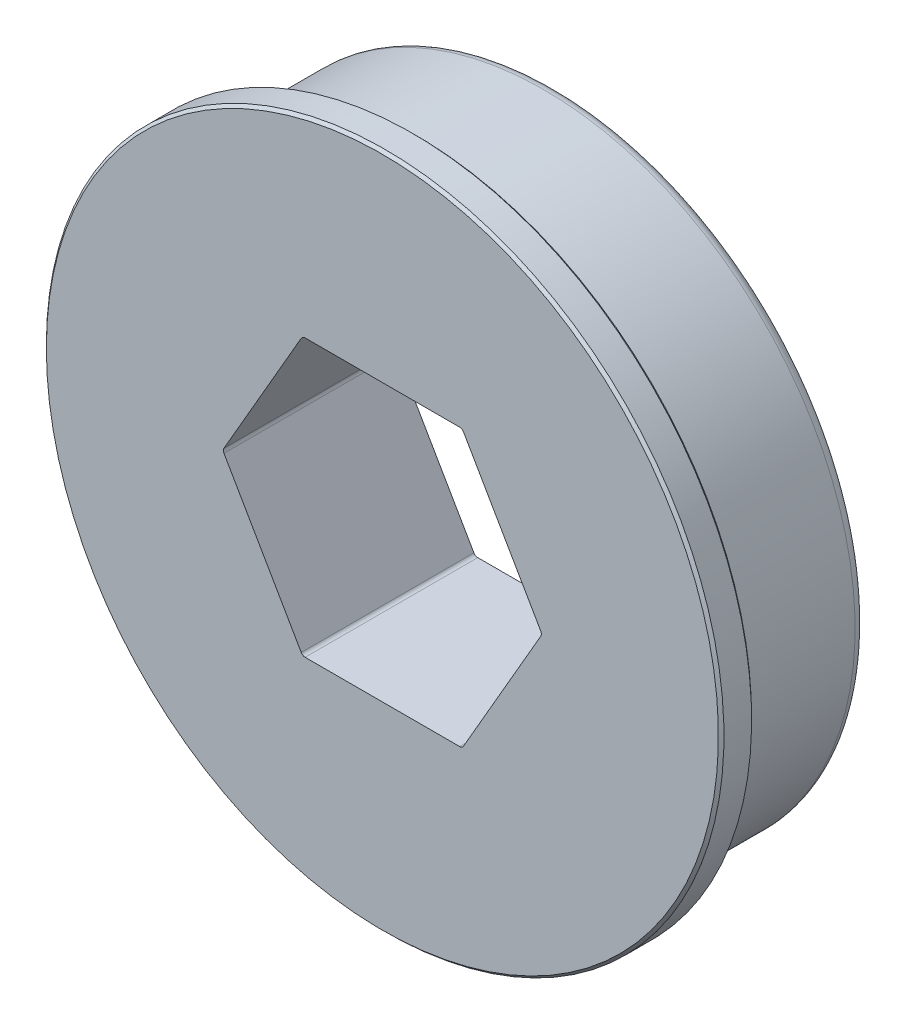
ISO-10303-21;
HEADER;
FILE_DESCRIPTION(('STEP AP214'),'2;1');
FILE_NAME('part.step','',(''),(''),'','','');
FILE_SCHEMA(('AUTOMOTIVE_DESIGN { 1 0 10303 214 1 1 1 1 }'));
ENDSEC;
DATA;
#1=APPLICATION_CONTEXT('core data for automotive mechanical design processes');
#2=APPLICATION_PROTOCOL_DEFINITION('international standard','automotive_design',2000,#1);
#3=PRODUCT_CONTEXT('',#1,'mechanical');
#4=PRODUCT('Part','Part','',(#3));
#5=PRODUCT_RELATED_PRODUCT_CATEGORY('part','',(#4));
#6=PRODUCT_DEFINITION_FORMATION('','',#4);
#7=PRODUCT_DEFINITION_CONTEXT('part definition',#1,'design');
#8=PRODUCT_DEFINITION('design','',#6,#7);
#9=PRODUCT_DEFINITION_SHAPE('','',#8);
#10=(LENGTH_UNIT() NAMED_UNIT(*) SI_UNIT(.MILLI.,.METRE.));
#11=(NAMED_UNIT(*) PLANE_ANGLE_UNIT() SI_UNIT($,.RADIAN.));
#12=(NAMED_UNIT(*) SI_UNIT($,.STERADIAN.) SOLID_ANGLE_UNIT());
#13=UNCERTAINTY_MEASURE_WITH_UNIT(LENGTH_MEASURE(1.E-05),#10,'distance_accuracy_value','');
#14=(GEOMETRIC_REPRESENTATION_CONTEXT(3) GLOBAL_UNCERTAINTY_ASSIGNED_CONTEXT((#13)) GLOBAL_UNIT_ASSIGNED_CONTEXT((#10,
#11,#12)) REPRESENTATION_CONTEXT('',''));
#15=CARTESIAN_POINT('',(0.,0.,0.));
#16=DIRECTION('',(0.,0.,1.));
#17=DIRECTION('',(1.,0.,0.));
#18=AXIS2_PLACEMENT_3D('',#15,#16,#17);
#19=CARTESIAN_POINT('',(0.,0.,7.92734));
#20=DIRECTION('',(0.,0.,-1.));
#21=DIRECTION('',(-1.,0.,0.));
#22=AXIS2_PLACEMENT_3D('',#19,#20,#21);
#23=CYLINDRICAL_SURFACE('',#22,13.97);
#24=CARTESIAN_POINT('',(0.,0.,6.40333999999999));
#25=DIRECTION('',(0.,0.,-1.));
#26=DIRECTION('',(-1.,0.,0.));
#27=AXIS2_PLACEMENT_3D('',#24,#25,#26);
#28=CIRCLE('',#27,13.97);
#29=CARTESIAN_POINT('',(-13.97,0.,6.40333999999999));
#30=VERTEX_POINT('',#29);
#31=EDGE_CURVE('E254',#30,#30,#28,.F.);
#32=ORIENTED_EDGE('',*,*,#31,.F.);
#33=EDGE_LOOP('',(#32));
#34=FACE_BOUND('',#33,.T.);
#35=CARTESIAN_POINT('',(0.,0.,5.89534));
#36=DIRECTION('',(0.,0.,-1.));
#37=DIRECTION('',(-1.,0.,0.));
#38=AXIS2_PLACEMENT_3D('',#35,#36,#37);
#39=CIRCLE('',#38,13.97);
#40=CARTESIAN_POINT('',(-13.97,0.,5.89534));
#41=VERTEX_POINT('',#40);
#42=EDGE_CURVE('E257',#41,#41,#39,.T.);
#43=ORIENTED_EDGE('',*,*,#42,.F.);
#44=EDGE_LOOP('',(#43));
#45=FACE_BOUND('',#44,.T.);
#46=ADVANCED_FACE('F16',(#34,#45),#23,.T.);
#47=CARTESIAN_POINT('',(14.2875,0.,5.89534));
#48=DIRECTION('',(0.,0.,1.));
#49=DIRECTION('',(1.,0.,0.));
#50=AXIS2_PLACEMENT_3D('',#47,#48,#49);
#51=PLANE('',#50);
#52=CARTESIAN_POINT('',(0.,0.,5.89534));
#53=DIRECTION('',(0.,0.,-1.));
#54=DIRECTION('',(-1.,0.,0.));
#55=AXIS2_PLACEMENT_3D('',#52,#53,#54);
#56=CIRCLE('',#55,14.2875);
#57=CARTESIAN_POINT('',(-14.2875,0.,5.89534));
#58=VERTEX_POINT('',#57);
#59=EDGE_CURVE('E251',#58,#58,#56,.T.);
#60=ORIENTED_EDGE('',*,*,#59,.F.);
#61=EDGE_LOOP('',(#60));
#62=FACE_BOUND('',#61,.T.);
#63=ORIENTED_EDGE('',*,*,#42,.T.);
#64=EDGE_LOOP('',(#63));
#65=FACE_BOUND('',#64,.T.);
#66=ADVANCED_FACE('F374',(#62,#65),#51,.T.);
#67=CARTESIAN_POINT('',(13.97,0.,6.40334));
#68=DIRECTION('',(0.,0.,-1.));
#69=DIRECTION('',(-1.,0.,0.));
#70=AXIS2_PLACEMENT_3D('',#67,#68,#69);
#71=PLANE('',#70);
#72=ORIENTED_EDGE('',*,*,#31,.T.);
#73=EDGE_LOOP('',(#72));
#74=FACE_BOUND('',#73,.T.);
#75=CARTESIAN_POINT('',(0.,0.,6.40334));
#76=DIRECTION('',(0.,0.,1.));
#77=DIRECTION('',(0.,-1.,0.));
#78=AXIS2_PLACEMENT_3D('',#75,#76,#77);
#79=CIRCLE('',#78,15.4305);
#80=CARTESIAN_POINT('',(0.,-15.4305,6.40334));
#81=VERTEX_POINT('',#80);
#82=EDGE_CURVE('E222',#81,#81,#79,.T.);
#83=ORIENTED_EDGE('',*,*,#82,.F.);
#84=EDGE_LOOP('',(#83));
#85=FACE_BOUND('',#84,.T.);
#86=ADVANCED_FACE('F372',(#74,#85),#71,.T.);
#87=CARTESIAN_POINT('',(0.,0.,7.92734));
#88=DIRECTION('',(0.,0.,-1.));
#89=DIRECTION('',(-1.,0.,0.));
#90=AXIS2_PLACEMENT_3D('',#87,#88,#89);
#91=CYLINDRICAL_SURFACE('',#90,14.2875);
#92=ORIENTED_EDGE('',*,*,#59,.T.);
#93=EDGE_LOOP('',(#92));
#94=FACE_BOUND('',#93,.T.);
#95=CARTESIAN_POINT('',(0.,0.,0.508));
#96=DIRECTION('',(0.,0.,-1.));
#97=DIRECTION('',(-1.,0.,0.));
#98=AXIS2_PLACEMENT_3D('',#95,#96,#97);
#99=CIRCLE('',#98,14.2875);
#100=CARTESIAN_POINT('',(-14.2875,0.,0.508));
#101=VERTEX_POINT('',#100);
#102=EDGE_CURVE('E219',#101,#101,#99,.T.);
#103=ORIENTED_EDGE('',*,*,#102,.F.);
#104=EDGE_LOOP('',(#103));
#105=FACE_BOUND('',#104,.T.);
#106=ADVANCED_FACE('F369',(#94,#105),#91,.T.);
#107=CARTESIAN_POINT('',(0.,0.,6.53034000000001));
#108=DIRECTION('',(0.,0.,1.));
#109=DIRECTION('',(0.,-1.,0.));
#110=AXIS2_PLACEMENT_3D('',#107,#108,#109);
#111=CONICAL_SURFACE('',#110,15.5575,0.785398163397469);
#112=CARTESIAN_POINT('',(0.,0.,6.53034000000001));
#113=DIRECTION('',(0.,0.,-1.));
#114=DIRECTION('',(-1.,0.,0.));
#115=AXIS2_PLACEMENT_3D('',#112,#113,#114);
#116=CIRCLE('',#115,15.5575);
#117=CARTESIAN_POINT('',(-15.5575,0.,6.53034000000001));
#118=VERTEX_POINT('',#117);
#119=EDGE_CURVE('E83',#118,#118,#116,.F.);
#120=ORIENTED_EDGE('',*,*,#119,.F.);
#121=EDGE_LOOP('',(#120));
#122=FACE_BOUND('',#121,.T.);
#123=ORIENTED_EDGE('',*,*,#82,.T.);
#124=EDGE_LOOP('',(#123));
#125=FACE_BOUND('',#124,.T.);
#126=ADVANCED_FACE('F204',(#122,#125),#111,.T.);
#127=CARTESIAN_POINT('',(0.,0.,0.508));
#128=DIRECTION('',(0.,0.,-1.));
#129=DIRECTION('',(-1.,0.,0.));
#130=AXIS2_PLACEMENT_3D('',#127,#128,#129);
#131=TOROIDAL_SURFACE('',#130,13.7795,0.508);
#132=ORIENTED_EDGE('',*,*,#102,.T.);
#133=EDGE_LOOP('',(#132));
#134=FACE_BOUND('',#133,.T.);
#135=CARTESIAN_POINT('',(0.,0.,0.));
#136=DIRECTION('',(0.,0.,1.));
#137=DIRECTION('',(-1.,0.,0.));
#138=AXIS2_PLACEMENT_3D('',#135,#136,#137);
#139=CIRCLE('',#138,13.7795);
#140=CARTESIAN_POINT('',(13.7795,0.,0.));
#141=VERTEX_POINT('',#140);
#142=CARTESIAN_POINT('',(-13.7795,0.,0.));
#143=VERTEX_POINT('',#142);
#144=EDGE_CURVE('E242',#141,#143,#139,.F.);
#145=ORIENTED_EDGE('',*,*,#144,.F.);
#146=CARTESIAN_POINT('',(0.,0.,0.));
#147=DIRECTION('',(0.,0.,1.));
#148=DIRECTION('',(1.,0.,0.));
#149=AXIS2_PLACEMENT_3D('',#146,#147,#148);
#150=CIRCLE('',#149,13.7795);
#151=EDGE_CURVE('E152',#143,#141,#150,.F.);
#152=ORIENTED_EDGE('',*,*,#151,.F.);
#153=EDGE_LOOP('',(#145,#152));
#154=FACE_BOUND('',#153,.T.);
#155=ADVANCED_FACE('F198',(#134,#154),#131,.T.);
#156=CARTESIAN_POINT('',(0.,0.,7.92734));
#157=DIRECTION('',(0.,0.,-1.));
#158=DIRECTION('',(-1.,0.,0.));
#159=AXIS2_PLACEMENT_3D('',#156,#157,#158);
#160=CYLINDRICAL_SURFACE('',#159,15.5575);
#161=ORIENTED_EDGE('',*,*,#119,.T.);
#162=EDGE_LOOP('',(#161));
#163=FACE_BOUND('',#162,.T.);
#164=CARTESIAN_POINT('',(0.,0.,7.80034));
#165=DIRECTION('',(0.,0.,-1.));
#166=DIRECTION('',(-1.,0.,0.));
#167=AXIS2_PLACEMENT_3D('',#164,#165,#166);
#168=CIRCLE('',#167,15.5575);
#169=CARTESIAN_POINT('',(-15.5575,0.,7.80034));
#170=VERTEX_POINT('',#169);
#171=EDGE_CURVE('E143',#170,#170,#168,.F.);
#172=ORIENTED_EDGE('',*,*,#171,.F.);
#173=EDGE_LOOP('',(#172));
#174=FACE_BOUND('',#173,.T.);
#175=ADVANCED_FACE('F203',(#163,#174),#160,.T.);
#176=CARTESIAN_POINT('',(-7.09771326930958,0.,7.92734));
#177=DIRECTION('',(0.,0.,1.));
#178=DIRECTION('',(1.,0.,0.));
#179=AXIS2_PLACEMENT_3D('',#176,#177,#178);
#180=CYLINDRICAL_SURFACE('',#179,0.2032);
#181=DIRECTION('',(0.,0.,1.));
#182=VECTOR('',#181,1.);
#183=CARTESIAN_POINT('',(-7.27368963135858,-0.101600000000005,7.92734));
#184=LINE('',#183,#182);
#185=CARTESIAN_POINT('',(-7.27368963135857,-0.101600000000005,7.92734));
#186=VERTEX_POINT('',#185);
#187=CARTESIAN_POINT('',(-7.27368963135858,-0.101600000000005,0.));
#188=VERTEX_POINT('',#187);
#189=EDGE_CURVE('E141',#186,#188,#184,.F.);
#190=ORIENTED_EDGE('',*,*,#189,.T.);
#191=CARTESIAN_POINT('',(-7.09771326930958,0.,0.));
#192=DIRECTION('',(0.,0.,1.));
#193=DIRECTION('',(1.,0.,0.));
#194=AXIS2_PLACEMENT_3D('',#191,#192,#193);
#195=CIRCLE('',#194,0.2032);
#196=CARTESIAN_POINT('',(-7.27368963135857,0.101599999999994,0.));
#197=VERTEX_POINT('',#196);
#198=EDGE_CURVE('E91',#197,#188,#195,.T.);
#199=ORIENTED_EDGE('',*,*,#198,.F.);
#200=DIRECTION('',(0.,0.,1.));
#201=VECTOR('',#200,1.);
#202=CARTESIAN_POINT('',(-7.27368963135857,0.101599999999994,7.92734));
#203=LINE('',#202,#201);
#204=CARTESIAN_POINT('',(-7.27368963135857,0.101599999999993,7.92734));
#205=VERTEX_POINT('',#204);
#206=EDGE_CURVE('E87',#197,#205,#203,.T.);
#207=ORIENTED_EDGE('',*,*,#206,.T.);
#208=CARTESIAN_POINT('',(-7.09771326930958,0.,7.92734));
#209=DIRECTION('',(0.,0.,1.));
#210=DIRECTION('',(1.,0.,0.));
#211=AXIS2_PLACEMENT_3D('',#208,#209,#210);
#212=CIRCLE('',#211,0.2032);
#213=EDGE_CURVE('E71',#186,#205,#212,.F.);
#214=ORIENTED_EDGE('',*,*,#213,.F.);
#215=EDGE_LOOP('',(#190,#199,#207,#214));
#216=FACE_BOUND('',#215,.T.);
#217=ADVANCED_FACE('F88',(#216),#180,.F.);
#218=CARTESIAN_POINT('',(-3.54885663465479,6.14679999999999,7.92734));
#219=DIRECTION('',(0.,0.,1.));
#220=DIRECTION('',(1.,0.,0.));
#221=AXIS2_PLACEMENT_3D('',#218,#219,#220);
#222=CYLINDRICAL_SURFACE('',#221,0.2032);
#223=DIRECTION('',(0.,0.,1.));
#224=VECTOR('',#223,1.);
#225=CARTESIAN_POINT('',(-3.72483299670379,6.24839999999999,7.92734));
#226=LINE('',#225,#224);
#227=CARTESIAN_POINT('',(-3.72483299670379,6.24839999999999,7.92734));
#228=VERTEX_POINT('',#227);
#229=CARTESIAN_POINT('',(-3.72483299670379,6.24839999999999,0.));
#230=VERTEX_POINT('',#229);
#231=EDGE_CURVE('E101',#228,#230,#226,.F.);
#232=ORIENTED_EDGE('',*,*,#231,.T.);
#233=CARTESIAN_POINT('',(-3.54885663465479,6.14679999999999,0.));
#234=DIRECTION('',(0.,0.,1.));
#235=DIRECTION('',(1.,0.,0.));
#236=AXIS2_PLACEMENT_3D('',#233,#234,#235);
#237=CIRCLE('',#236,0.2032);
#238=CARTESIAN_POINT('',(-3.54885663465479,6.34999999999999,0.));
#239=VERTEX_POINT('',#238);
#240=EDGE_CURVE('E229',#239,#230,#237,.T.);
#241=ORIENTED_EDGE('',*,*,#240,.F.);
#242=DIRECTION('',(0.,0.,1.));
#243=VECTOR('',#242,1.);
#244=CARTESIAN_POINT('',(-3.54885663465479,6.34999999999999,7.92734));
#245=LINE('',#244,#243);
#246=CARTESIAN_POINT('',(-3.54885663465479,6.34999999999999,7.92734));
#247=VERTEX_POINT('',#246);
#248=EDGE_CURVE('E95',#239,#247,#245,.T.);
#249=ORIENTED_EDGE('',*,*,#248,.T.);
#250=CARTESIAN_POINT('',(-3.54885663465479,6.14679999999999,7.92734));
#251=DIRECTION('',(0.,0.,1.));
#252=DIRECTION('',(1.,0.,0.));
#253=AXIS2_PLACEMENT_3D('',#250,#251,#252);
#254=CIRCLE('',#253,0.2032);
#255=EDGE_CURVE('E82',#228,#247,#254,.F.);
#256=ORIENTED_EDGE('',*,*,#255,.F.);
#257=EDGE_LOOP('',(#232,#241,#249,#256));
#258=FACE_BOUND('',#257,.T.);
#259=ADVANCED_FACE('F319',(#258),#222,.F.);
#260=CARTESIAN_POINT('',(3.5488566346548,6.1468,7.92734));
#261=DIRECTION('',(0.,0.,1.));
#262=DIRECTION('',(1.,0.,0.));
#263=AXIS2_PLACEMENT_3D('',#260,#261,#262);
#264=CYLINDRICAL_SURFACE('',#263,0.2032);
#265=DIRECTION('',(0.,0.,1.));
#266=VECTOR('',#265,1.);
#267=CARTESIAN_POINT('',(3.5488566346548,6.35,7.92734));
#268=LINE('',#267,#266);
#269=CARTESIAN_POINT('',(3.5488566346548,6.34999999999999,7.92734));
#270=VERTEX_POINT('',#269);
#271=CARTESIAN_POINT('',(3.5488566346548,6.35,0.));
#272=VERTEX_POINT('',#271);
#273=EDGE_CURVE('E134',#270,#272,#268,.F.);
#274=ORIENTED_EDGE('',*,*,#273,.T.);
#275=CARTESIAN_POINT('',(3.5488566346548,6.1468,0.));
#276=DIRECTION('',(0.,0.,1.));
#277=DIRECTION('',(1.,0.,0.));
#278=AXIS2_PLACEMENT_3D('',#275,#276,#277);
#279=CIRCLE('',#278,0.2032);
#280=CARTESIAN_POINT('',(3.7248329967038,6.2484,0.));
#281=VERTEX_POINT('',#280);
#282=EDGE_CURVE('E232',#281,#272,#279,.T.);
#283=ORIENTED_EDGE('',*,*,#282,.F.);
#284=DIRECTION('',(0.,0.,1.));
#285=VECTOR('',#284,1.);
#286=CARTESIAN_POINT('',(3.72483299670379,6.2484,7.92734));
#287=LINE('',#286,#285);
#288=CARTESIAN_POINT('',(3.7248329967038,6.2484,7.92734));
#289=VERTEX_POINT('',#288);
#290=EDGE_CURVE('E124',#281,#289,#287,.T.);
#291=ORIENTED_EDGE('',*,*,#290,.T.);
#292=CARTESIAN_POINT('',(3.5488566346548,6.1468,7.92734));
#293=DIRECTION('',(0.,0.,1.));
#294=DIRECTION('',(1.,0.,0.));
#295=AXIS2_PLACEMENT_3D('',#292,#293,#294);
#296=CIRCLE('',#295,0.2032);
#297=EDGE_CURVE('E246',#270,#289,#296,.F.);
#298=ORIENTED_EDGE('',*,*,#297,.F.);
#299=EDGE_LOOP('',(#274,#283,#291,#298));
#300=FACE_BOUND('',#299,.T.);
#301=ADVANCED_FACE('F325',(#300),#264,.F.);
#302=CARTESIAN_POINT('',(7.09771326930959,0.,7.92734));
#303=DIRECTION('',(0.,0.,1.));
#304=DIRECTION('',(1.,0.,0.));
#305=AXIS2_PLACEMENT_3D('',#302,#303,#304);
#306=CYLINDRICAL_SURFACE('',#305,0.2032);
#307=CARTESIAN_POINT('',(7.09771326930959,0.,0.));
#308=DIRECTION('',(0.,0.,1.));
#309=DIRECTION('',(1.,0.,0.));
#310=AXIS2_PLACEMENT_3D('',#307,#308,#309);
#311=CIRCLE('',#310,0.2032);
#312=CARTESIAN_POINT('',(7.27368963135859,-0.101600000000005,0.));
#313=VERTEX_POINT('',#312);
#314=CARTESIAN_POINT('',(7.27368963135859,0.101599999999995,0.));
#315=VERTEX_POINT('',#314);
#316=EDGE_CURVE('E235',#313,#315,#311,.T.);
#317=ORIENTED_EDGE('',*,*,#316,.F.);
#318=DIRECTION('',(0.,0.,1.));
#319=VECTOR('',#318,1.);
#320=CARTESIAN_POINT('',(7.27368963135859,-0.101600000000005,7.92734));
#321=LINE('',#320,#319);
#322=CARTESIAN_POINT('',(7.27368963135859,-0.101600000000005,7.92734));
#323=VERTEX_POINT('',#322);
#324=EDGE_CURVE('E117',#313,#323,#321,.T.);
#325=ORIENTED_EDGE('',*,*,#324,.T.);
#326=CARTESIAN_POINT('',(7.09771326930959,0.,7.92734));
#327=DIRECTION('',(0.,0.,1.));
#328=DIRECTION('',(1.,0.,0.));
#329=AXIS2_PLACEMENT_3D('',#326,#327,#328);
#330=CIRCLE('',#329,0.2032);
#331=CARTESIAN_POINT('',(7.27368963135859,0.101599999999995,7.92734));
#332=VERTEX_POINT('',#331);
#333=EDGE_CURVE('E244',#332,#323,#330,.F.);
#334=ORIENTED_EDGE('',*,*,#333,.F.);
#335=DIRECTION('',(0.,0.,1.));
#336=VECTOR('',#335,1.);
#337=CARTESIAN_POINT('',(7.27368963135859,0.101599999999995,7.92734));
#338=LINE('',#337,#336);
#339=EDGE_CURVE('E128',#332,#315,#338,.F.);
#340=ORIENTED_EDGE('',*,*,#339,.T.);
#341=EDGE_LOOP('',(#317,#325,#334,#340));
#342=FACE_BOUND('',#341,.T.);
#343=ADVANCED_FACE('F306',(#342),#306,.F.);
#344=CARTESIAN_POINT('',(-3.54885663465478,-6.14680000000001,7.92734));
#345=DIRECTION('',(0.,0.,1.));
#346=DIRECTION('',(1.,0.,0.));
#347=AXIS2_PLACEMENT_3D('',#344,#345,#346);
#348=CYLINDRICAL_SURFACE('',#347,0.2032);
#349=DIRECTION('',(0.,0.,-1.));
#350=VECTOR('',#349,1.);
#351=CARTESIAN_POINT('',(-3.54885663465478,-6.35000000000001,7.92734));
#352=LINE('',#351,#350);
#353=CARTESIAN_POINT('',(-3.54885663465478,-6.35000000000001,7.92734));
#354=VERTEX_POINT('',#353);
#355=CARTESIAN_POINT('',(-3.54885663465478,-6.35000000000001,0.));
#356=VERTEX_POINT('',#355);
#357=EDGE_CURVE('E115',#354,#356,#352,.T.);
#358=ORIENTED_EDGE('',*,*,#357,.T.);
#359=CARTESIAN_POINT('',(-3.54885663465478,-6.14680000000001,0.));
#360=DIRECTION('',(0.,0.,1.));
#361=DIRECTION('',(1.,0.,0.));
#362=AXIS2_PLACEMENT_3D('',#359,#360,#361);
#363=CIRCLE('',#362,0.2032);
#364=CARTESIAN_POINT('',(-3.72483299670378,-6.24840000000001,0.));
#365=VERTEX_POINT('',#364);
#366=EDGE_CURVE('E238',#365,#356,#363,.T.);
#367=ORIENTED_EDGE('',*,*,#366,.F.);
#368=DIRECTION('',(0.,0.,1.));
#369=VECTOR('',#368,1.);
#370=CARTESIAN_POINT('',(-3.72483299670378,-6.24840000000001,7.92734));
#371=LINE('',#370,#369);
#372=CARTESIAN_POINT('',(-3.72483299670378,-6.24840000000001,7.92734));
#373=VERTEX_POINT('',#372);
#374=EDGE_CURVE('E138',#365,#373,#371,.T.);
#375=ORIENTED_EDGE('',*,*,#374,.T.);
#376=CARTESIAN_POINT('',(-3.54885663465478,-6.14680000000001,7.92734));
#377=DIRECTION('',(0.,0.,1.));
#378=DIRECTION('',(1.,0.,0.));
#379=AXIS2_PLACEMENT_3D('',#376,#377,#378);
#380=CIRCLE('',#379,0.2032);
#381=EDGE_CURVE('E36',#354,#373,#380,.F.);
#382=ORIENTED_EDGE('',*,*,#381,.F.);
#383=EDGE_LOOP('',(#358,#367,#375,#382));
#384=FACE_BOUND('',#383,.T.);
#385=ADVANCED_FACE('F169',(#384),#348,.F.);
#386=CARTESIAN_POINT('',(0.,0.,0.));
#387=DIRECTION('',(0.,0.,-1.));
#388=DIRECTION('',(-1.,0.,0.));
#389=AXIS2_PLACEMENT_3D('',#386,#387,#388);
#390=PLANE('',#389);
#391=DIRECTION('',(-1.,0.,0.));
#392=VECTOR('',#391,1.);
#393=CARTESIAN_POINT('',(-3.66617420935412,6.34999999999999,0.));
#394=LINE('',#393,#392);
#395=EDGE_CURVE('E131',#272,#239,#394,.T.);
#396=ORIENTED_EDGE('',*,*,#395,.T.);
#397=ORIENTED_EDGE('',*,*,#240,.T.);
#398=DIRECTION('',(-0.5,-0.866025403784439,0.));
#399=VECTOR('',#398,1.);
#400=CARTESIAN_POINT('',(-7.33234841870824,0.,0.));
#401=LINE('',#400,#399);
#402=EDGE_CURVE('E96',#230,#197,#401,.T.);
#403=ORIENTED_EDGE('',*,*,#402,.T.);
#404=ORIENTED_EDGE('',*,*,#198,.T.);
#405=DIRECTION('',(0.5,-0.866025403784439,0.));
#406=VECTOR('',#405,1.);
#407=CARTESIAN_POINT('',(-3.66617420935411,-6.35000000000001,0.));
#408=LINE('',#407,#406);
#409=EDGE_CURVE('E140',#188,#365,#408,.T.);
#410=ORIENTED_EDGE('',*,*,#409,.T.);
#411=ORIENTED_EDGE('',*,*,#366,.T.);
#412=DIRECTION('',(1.,0.,0.));
#413=VECTOR('',#412,1.);
#414=CARTESIAN_POINT('',(3.66617420935413,-6.35000000000001,0.));
#415=LINE('',#414,#413);
#416=CARTESIAN_POINT('',(3.5488566346548,-6.35000000000001,0.));
#417=VERTEX_POINT('',#416);
#418=EDGE_CURVE('E114',#356,#417,#415,.T.);
#419=ORIENTED_EDGE('',*,*,#418,.T.);
#420=CARTESIAN_POINT('',(3.5488566346548,-6.14680000000001,0.));
#421=DIRECTION('',(0.,0.,1.));
#422=DIRECTION('',(1.,0.,0.));
#423=AXIS2_PLACEMENT_3D('',#420,#421,#422);
#424=CIRCLE('',#423,0.2032);
#425=CARTESIAN_POINT('',(3.7248329967038,-6.24840000000001,0.));
#426=VERTEX_POINT('',#425);
#427=EDGE_CURVE('E226',#417,#426,#424,.T.);
#428=ORIENTED_EDGE('',*,*,#427,.T.);
#429=DIRECTION('',(0.5,0.866025403784439,0.));
#430=VECTOR('',#429,1.);
#431=CARTESIAN_POINT('',(7.33234841870825,0.,0.));
#432=LINE('',#431,#430);
#433=EDGE_CURVE('E120',#426,#313,#432,.T.);
#434=ORIENTED_EDGE('',*,*,#433,.T.);
#435=ORIENTED_EDGE('',*,*,#316,.T.);
#436=DIRECTION('',(-0.5,0.866025403784439,0.));
#437=VECTOR('',#436,1.);
#438=CARTESIAN_POINT('',(3.66617420935413,6.35,0.));
#439=LINE('',#438,#437);
#440=EDGE_CURVE('E127',#315,#281,#439,.T.);
#441=ORIENTED_EDGE('',*,*,#440,.T.);
#442=ORIENTED_EDGE('',*,*,#282,.T.);
#443=EDGE_LOOP('',(#396,#397,#403,#404,#410,#411,#419,#428,#434,#435,#441,#442));
#444=FACE_BOUND('',#443,.T.);
#445=ORIENTED_EDGE('',*,*,#151,.T.);
#446=ORIENTED_EDGE('',*,*,#144,.T.);
#447=EDGE_LOOP('',(#445,#446));
#448=FACE_BOUND('',#447,.T.);
#449=ADVANCED_FACE('F158',(#444,#448),#390,.T.);
#450=CARTESIAN_POINT('',(3.5488566346548,-6.14680000000001,7.92734));
#451=DIRECTION('',(0.,0.,1.));
#452=DIRECTION('',(1.,0.,0.));
#453=AXIS2_PLACEMENT_3D('',#450,#451,#452);
#454=CYLINDRICAL_SURFACE('',#453,0.2032);
#455=DIRECTION('',(0.,0.,1.));
#456=VECTOR('',#455,1.);
#457=CARTESIAN_POINT('',(3.7248329967038,-6.2484,7.92734));
#458=LINE('',#457,#456);
#459=CARTESIAN_POINT('',(3.7248329967038,-6.2484,7.92734));
#460=VERTEX_POINT('',#459);
#461=EDGE_CURVE('E121',#460,#426,#458,.F.);
#462=ORIENTED_EDGE('',*,*,#461,.T.);
#463=ORIENTED_EDGE('',*,*,#427,.F.);
#464=DIRECTION('',(0.,0.,-1.));
#465=VECTOR('',#464,1.);
#466=CARTESIAN_POINT('',(3.5488566346548,-6.35000000000001,7.92734));
#467=LINE('',#466,#465);
#468=CARTESIAN_POINT('',(3.5488566346548,-6.35000000000001,7.92734));
#469=VERTEX_POINT('',#468);
#470=EDGE_CURVE('E111',#417,#469,#467,.F.);
#471=ORIENTED_EDGE('',*,*,#470,.T.);
#472=CARTESIAN_POINT('',(3.5488566346548,-6.14680000000001,7.92734));
#473=DIRECTION('',(0.,0.,1.));
#474=DIRECTION('',(1.,0.,0.));
#475=AXIS2_PLACEMENT_3D('',#472,#473,#474);
#476=CIRCLE('',#475,0.2032);
#477=EDGE_CURVE('E193',#460,#469,#476,.F.);
#478=ORIENTED_EDGE('',*,*,#477,.F.);
#479=EDGE_LOOP('',(#462,#463,#471,#478));
#480=FACE_BOUND('',#479,.T.);
#481=ADVANCED_FACE('F168',(#480),#454,.F.);
#482=CARTESIAN_POINT('',(0.,0.,7.80034));
#483=DIRECTION('',(0.,0.,-1.));
#484=DIRECTION('',(-1.,0.,0.));
#485=AXIS2_PLACEMENT_3D('',#482,#483,#484);
#486=CONICAL_SURFACE('',#485,15.5575,0.785398163397442);
#487=ORIENTED_EDGE('',*,*,#171,.T.);
#488=EDGE_LOOP('',(#487));
#489=FACE_BOUND('',#488,.T.);
#490=CARTESIAN_POINT('',(0.,0.,7.92734));
#491=DIRECTION('',(0.,0.,-1.));
#492=DIRECTION('',(-1.,0.,0.));
#493=AXIS2_PLACEMENT_3D('',#490,#491,#492);
#494=CIRCLE('',#493,15.4305);
#495=CARTESIAN_POINT('',(-15.4305,0.,7.92734));
#496=VERTEX_POINT('',#495);
#497=EDGE_CURVE('E107',#496,#496,#494,.F.);
#498=ORIENTED_EDGE('',*,*,#497,.F.);
#499=EDGE_LOOP('',(#498));
#500=FACE_BOUND('',#499,.T.);
#501=ADVANCED_FACE('F350',(#489,#500),#486,.T.);
#502=CARTESIAN_POINT('',(-3.66617420935411,-6.35000000000001,7.92734));
#503=DIRECTION('',(-0.866025403784439,-0.5,0.));
#504=DIRECTION('',(0.5,-0.866025403784439,0.));
#505=AXIS2_PLACEMENT_3D('',#502,#503,#504);
#506=PLANE('',#505);
#507=ORIENTED_EDGE('',*,*,#374,.F.);
#508=ORIENTED_EDGE('',*,*,#409,.F.);
#509=ORIENTED_EDGE('',*,*,#189,.F.);
#510=DIRECTION('',(-0.5,0.866025403784438,0.));
#511=VECTOR('',#510,1.);
#512=CARTESIAN_POINT('',(-3.72483299670378,-6.24840000000001,7.92734));
#513=LINE('',#512,#511);
#514=EDGE_CURVE('E81',#373,#186,#513,.T.);
#515=ORIENTED_EDGE('',*,*,#514,.F.);
#516=EDGE_LOOP('',(#507,#508,#509,#515));
#517=FACE_BOUND('',#516,.T.);
#518=ADVANCED_FACE('F315',(#517),#506,.F.);
#519=CARTESIAN_POINT('',(-7.33234841870824,0.,7.92734));
#520=DIRECTION('',(-0.866025403784439,0.5,0.));
#521=DIRECTION('',(-0.5,-0.866025403784439,0.));
#522=AXIS2_PLACEMENT_3D('',#519,#520,#521);
#523=PLANE('',#522);
#524=ORIENTED_EDGE('',*,*,#206,.F.);
#525=ORIENTED_EDGE('',*,*,#402,.F.);
#526=ORIENTED_EDGE('',*,*,#231,.F.);
#527=DIRECTION('',(0.5,0.866025403784439,0.));
#528=VECTOR('',#527,1.);
#529=CARTESIAN_POINT('',(-7.27368963135857,0.101599999999993,7.92734));
#530=LINE('',#529,#528);
#531=EDGE_CURVE('E79',#205,#228,#530,.T.);
#532=ORIENTED_EDGE('',*,*,#531,.F.);
#533=EDGE_LOOP('',(#524,#525,#526,#532));
#534=FACE_BOUND('',#533,.T.);
#535=ADVANCED_FACE('F99',(#534),#523,.F.);
#536=CARTESIAN_POINT('',(-3.66617420935412,6.34999999999999,7.92734));
#537=DIRECTION('',(0.,1.,0.));
#538=DIRECTION('',(-1.,0.,0.));
#539=AXIS2_PLACEMENT_3D('',#536,#537,#538);
#540=PLANE('',#539);
#541=ORIENTED_EDGE('',*,*,#273,.F.);
#542=DIRECTION('',(1.,0.,0.));
#543=VECTOR('',#542,1.);
#544=CARTESIAN_POINT('',(15.5575,6.34999999999999,7.92734));
#545=LINE('',#544,#543);
#546=EDGE_CURVE('E102',#247,#270,#545,.T.);
#547=ORIENTED_EDGE('',*,*,#546,.F.);
#548=ORIENTED_EDGE('',*,*,#248,.F.);
#549=ORIENTED_EDGE('',*,*,#395,.F.);
#550=EDGE_LOOP('',(#541,#547,#548,#549));
#551=FACE_BOUND('',#550,.T.);
#552=ADVANCED_FACE('F323',(#551),#540,.F.);
#553=CARTESIAN_POINT('',(3.66617420935413,6.35,7.92734));
#554=DIRECTION('',(0.866025403784439,0.5,0.));
#555=DIRECTION('',(-0.5,0.866025403784439,0.));
#556=AXIS2_PLACEMENT_3D('',#553,#554,#555);
#557=PLANE('',#556);
#558=ORIENTED_EDGE('',*,*,#290,.F.);
#559=ORIENTED_EDGE('',*,*,#440,.F.);
#560=ORIENTED_EDGE('',*,*,#339,.F.);
#561=DIRECTION('',(0.5,-0.866025403784439,0.));
#562=VECTOR('',#561,1.);
#563=CARTESIAN_POINT('',(3.7248329967038,6.2484,7.92734));
#564=LINE('',#563,#562);
#565=EDGE_CURVE('E105',#289,#332,#564,.T.);
#566=ORIENTED_EDGE('',*,*,#565,.F.);
#567=EDGE_LOOP('',(#558,#559,#560,#566));
#568=FACE_BOUND('',#567,.T.);
#569=ADVANCED_FACE('F312',(#568),#557,.F.);
#570=CARTESIAN_POINT('',(7.33234841870825,0.,7.92734));
#571=DIRECTION('',(0.866025403784439,-0.5,0.));
#572=DIRECTION('',(0.5,0.866025403784439,0.));
#573=AXIS2_PLACEMENT_3D('',#570,#571,#572);
#574=PLANE('',#573);
#575=ORIENTED_EDGE('',*,*,#324,.F.);
#576=ORIENTED_EDGE('',*,*,#433,.F.);
#577=ORIENTED_EDGE('',*,*,#461,.F.);
#578=DIRECTION('',(-0.5,-0.866025403784439,0.));
#579=VECTOR('',#578,1.);
#580=CARTESIAN_POINT('',(7.27368963135859,-0.101600000000005,7.92734));
#581=LINE('',#580,#579);
#582=EDGE_CURVE('E27',#323,#460,#581,.T.);
#583=ORIENTED_EDGE('',*,*,#582,.F.);
#584=EDGE_LOOP('',(#575,#576,#577,#583));
#585=FACE_BOUND('',#584,.T.);
#586=ADVANCED_FACE('F303',(#585),#574,.F.);
#587=CARTESIAN_POINT('',(3.66617420935413,-6.35000000000001,7.92734));
#588=DIRECTION('',(0.,-1.,0.));
#589=DIRECTION('',(0.,0.,-1.));
#590=AXIS2_PLACEMENT_3D('',#587,#588,#589);
#591=PLANE('',#590);
#592=ORIENTED_EDGE('',*,*,#470,.F.);
#593=ORIENTED_EDGE('',*,*,#418,.F.);
#594=ORIENTED_EDGE('',*,*,#357,.F.);
#595=DIRECTION('',(1.,0.,0.));
#596=VECTOR('',#595,1.);
#597=CARTESIAN_POINT('',(15.5575,-6.35000000000001,7.92734));
#598=LINE('',#597,#596);
#599=EDGE_CURVE('E11',#469,#354,#598,.F.);
#600=ORIENTED_EDGE('',*,*,#599,.F.);
#601=EDGE_LOOP('',(#592,#593,#594,#600));
#602=FACE_BOUND('',#601,.T.);
#603=ADVANCED_FACE('F295',(#602),#591,.F.);
#604=CARTESIAN_POINT('',(15.5575,0.,7.92734));
#605=DIRECTION('',(0.,0.,1.));
#606=DIRECTION('',(1.,0.,0.));
#607=AXIS2_PLACEMENT_3D('',#604,#605,#606);
#608=PLANE('',#607);
#609=ORIENTED_EDGE('',*,*,#599,.T.);
#610=ORIENTED_EDGE('',*,*,#381,.T.);
#611=ORIENTED_EDGE('',*,*,#514,.T.);
#612=ORIENTED_EDGE('',*,*,#213,.T.);
#613=ORIENTED_EDGE('',*,*,#531,.T.);
#614=ORIENTED_EDGE('',*,*,#255,.T.);
#615=ORIENTED_EDGE('',*,*,#546,.T.);
#616=ORIENTED_EDGE('',*,*,#297,.T.);
#617=ORIENTED_EDGE('',*,*,#565,.T.);
#618=ORIENTED_EDGE('',*,*,#333,.T.);
#619=ORIENTED_EDGE('',*,*,#582,.T.);
#620=ORIENTED_EDGE('',*,*,#477,.T.);
#621=EDGE_LOOP('',(#609,#610,#611,#612,#613,#614,#615,#616,#617,#618,#619,#620));
#622=FACE_BOUND('',#621,.T.);
#623=ORIENTED_EDGE('',*,*,#497,.T.);
#624=EDGE_LOOP('',(#623));
#625=FACE_BOUND('',#624,.T.);
#626=ADVANCED_FACE('F76',(#622,#625),#608,.T.);
#627=CLOSED_SHELL('',(#46,#66,#86,#106,#126,#155,#175,#217,#259,#301,#343,#385,#449,#481,#501,
#518,#535,#552,#569,#586,#603,#626));
#628=MANIFOLD_SOLID_BREP('B1',#627);
#629=ADVANCED_BREP_SHAPE_REPRESENTATION('',(#18,#628),#14);
#630=SHAPE_DEFINITION_REPRESENTATION(#9,#629);
ENDSEC;
END-ISO-10303-21;
